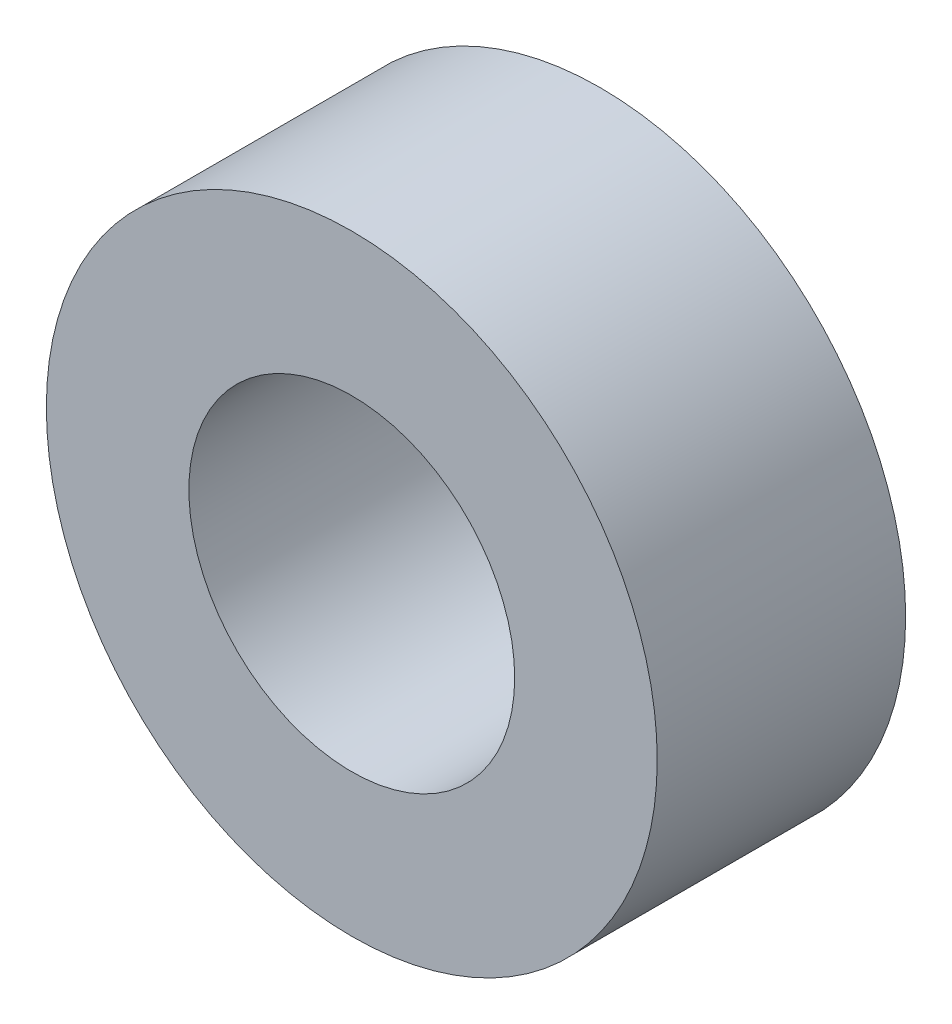
ISO-10303-21;
HEADER;
FILE_DESCRIPTION(('STEP AP214'),'2;1');
FILE_NAME('part.step','',(''),(''),'','','');
FILE_SCHEMA(('AUTOMOTIVE_DESIGN { 1 0 10303 214 1 1 1 1 }'));
ENDSEC;
DATA;
#1=APPLICATION_CONTEXT('core data for automotive mechanical design processes');
#2=APPLICATION_PROTOCOL_DEFINITION('international standard','automotive_design',2000,#1);
#3=PRODUCT_CONTEXT('',#1,'mechanical');
#4=PRODUCT('Part','Part','',(#3));
#5=PRODUCT_RELATED_PRODUCT_CATEGORY('part','',(#4));
#6=PRODUCT_DEFINITION_FORMATION('','',#4);
#7=PRODUCT_DEFINITION_CONTEXT('part definition',#1,'design');
#8=PRODUCT_DEFINITION('design','',#6,#7);
#9=PRODUCT_DEFINITION_SHAPE('','',#8);
#10=(LENGTH_UNIT() NAMED_UNIT(*) SI_UNIT(.MILLI.,.METRE.));
#11=(NAMED_UNIT(*) PLANE_ANGLE_UNIT() SI_UNIT($,.RADIAN.));
#12=(NAMED_UNIT(*) SI_UNIT($,.STERADIAN.) SOLID_ANGLE_UNIT());
#13=UNCERTAINTY_MEASURE_WITH_UNIT(LENGTH_MEASURE(1.E-05),#10,'distance_accuracy_value','');
#14=(GEOMETRIC_REPRESENTATION_CONTEXT(3) GLOBAL_UNCERTAINTY_ASSIGNED_CONTEXT((#13)) GLOBAL_UNIT_ASSIGNED_CONTEXT((#10,
#11,#12)) REPRESENTATION_CONTEXT('',''));
#15=CARTESIAN_POINT('',(0.,0.,0.));
#16=DIRECTION('',(0.,0.,1.));
#17=DIRECTION('',(1.,0.,0.));
#18=AXIS2_PLACEMENT_3D('',#15,#16,#17);
#19=CARTESIAN_POINT('',(0.,0.,6.1));
#20=DIRECTION('',(0.,0.,1.));
#21=DIRECTION('',(1.,0.,0.));
#22=AXIS2_PLACEMENT_3D('',#19,#20,#21);
#23=PLANE('',#22);
#24=CARTESIAN_POINT('',(0.,0.,6.1));
#25=DIRECTION('',(0.,0.,1.));
#26=DIRECTION('',(1.,0.,0.));
#27=AXIS2_PLACEMENT_3D('',#24,#25,#26);
#28=CIRCLE('',#27,7.5);
#29=CARTESIAN_POINT('',(7.5,0.,6.1));
#30=VERTEX_POINT('',#29);
#31=EDGE_CURVE('E10',#30,#30,#28,.T.);
#32=ORIENTED_EDGE('',*,*,#31,.T.);
#33=EDGE_LOOP('',(#32));
#34=FACE_BOUND('',#33,.T.);
#35=CARTESIAN_POINT('',(0.,0.,6.1));
#36=DIRECTION('',(0.,0.,1.));
#37=DIRECTION('',(1.,0.,0.));
#38=AXIS2_PLACEMENT_3D('',#35,#36,#37);
#39=CIRCLE('',#38,4.);
#40=CARTESIAN_POINT('',(4.,0.,6.1));
#41=VERTEX_POINT('',#40);
#42=EDGE_CURVE('E42',#41,#41,#39,.T.);
#43=ORIENTED_EDGE('',*,*,#42,.F.);
#44=EDGE_LOOP('',(#43));
#45=FACE_BOUND('',#44,.T.);
#46=ADVANCED_FACE('F31',(#34,#45),#23,.T.);
#47=CARTESIAN_POINT('',(0.,0.,0.));
#48=DIRECTION('',(0.,0.,1.));
#49=DIRECTION('',(1.,0.,0.));
#50=AXIS2_PLACEMENT_3D('',#47,#48,#49);
#51=PLANE('',#50);
#52=CARTESIAN_POINT('',(0.,0.,0.));
#53=DIRECTION('',(0.,0.,1.));
#54=DIRECTION('',(1.,0.,0.));
#55=AXIS2_PLACEMENT_3D('',#52,#53,#54);
#56=CIRCLE('',#55,7.5);
#57=CARTESIAN_POINT('',(7.5,0.,0.));
#58=VERTEX_POINT('',#57);
#59=EDGE_CURVE('E35',#58,#58,#56,.T.);
#60=ORIENTED_EDGE('',*,*,#59,.F.);
#61=EDGE_LOOP('',(#60));
#62=FACE_BOUND('',#61,.T.);
#63=CARTESIAN_POINT('',(0.,0.,0.));
#64=DIRECTION('',(0.,0.,1.));
#65=DIRECTION('',(1.,0.,0.));
#66=AXIS2_PLACEMENT_3D('',#63,#64,#65);
#67=CIRCLE('',#66,4.);
#68=CARTESIAN_POINT('',(4.,0.,0.));
#69=VERTEX_POINT('',#68);
#70=EDGE_CURVE('E44',#69,#69,#67,.T.);
#71=ORIENTED_EDGE('',*,*,#70,.T.);
#72=EDGE_LOOP('',(#71));
#73=FACE_BOUND('',#72,.T.);
#74=ADVANCED_FACE('F54',(#62,#73),#51,.F.);
#75=CARTESIAN_POINT('',(0.,0.,6.1));
#76=DIRECTION('',(0.,0.,-1.));
#77=DIRECTION('',(-1.,0.,0.));
#78=AXIS2_PLACEMENT_3D('',#75,#76,#77);
#79=CYLINDRICAL_SURFACE('',#78,7.5);
#80=ORIENTED_EDGE('',*,*,#31,.F.);
#81=EDGE_LOOP('',(#80));
#82=FACE_BOUND('',#81,.T.);
#83=ORIENTED_EDGE('',*,*,#59,.T.);
#84=EDGE_LOOP('',(#83));
#85=FACE_BOUND('',#84,.T.);
#86=ADVANCED_FACE('F33',(#82,#85),#79,.T.);
#87=CARTESIAN_POINT('',(0.,0.,6.1));
#88=DIRECTION('',(0.,0.,-1.));
#89=DIRECTION('',(-1.,0.,0.));
#90=AXIS2_PLACEMENT_3D('',#87,#88,#89);
#91=CYLINDRICAL_SURFACE('',#90,4.);
#92=ORIENTED_EDGE('',*,*,#42,.T.);
#93=EDGE_LOOP('',(#92));
#94=FACE_BOUND('',#93,.T.);
#95=ORIENTED_EDGE('',*,*,#70,.F.);
#96=EDGE_LOOP('',(#95));
#97=FACE_BOUND('',#96,.T.);
#98=ADVANCED_FACE('F50',(#94,#97),#91,.F.);
#99=CLOSED_SHELL('',(#46,#74,#86,#98));
#100=MANIFOLD_SOLID_BREP('B2',#99);
#101=ADVANCED_BREP_SHAPE_REPRESENTATION('',(#18,#100),#14);
#102=SHAPE_DEFINITION_REPRESENTATION(#9,#101);
ENDSEC;
END-ISO-10303-21;
